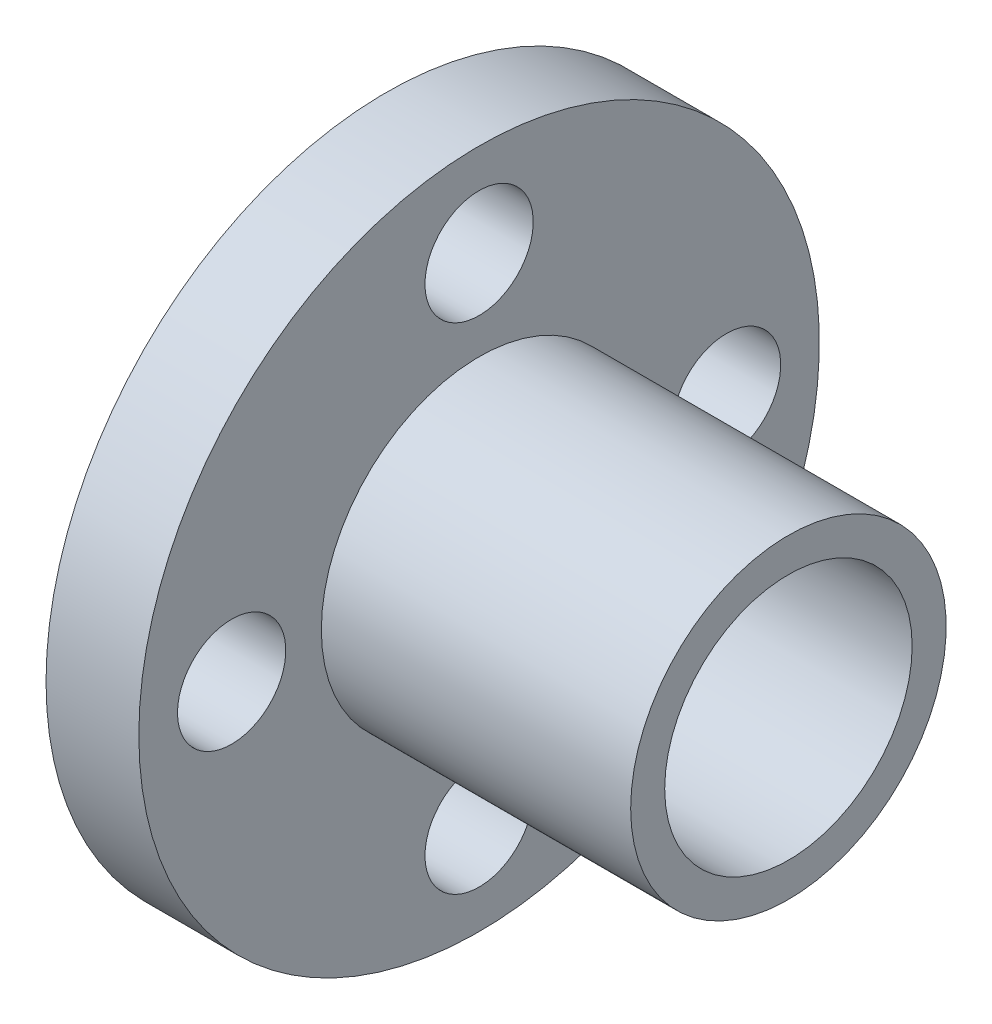
ISO-10303-21;
HEADER;
FILE_DESCRIPTION(('STEP AP214'),'2;1');
FILE_NAME('part.step','',(''),(''),'','','');
FILE_SCHEMA(('AUTOMOTIVE_DESIGN { 1 0 10303 214 1 1 1 1 }'));
ENDSEC;
DATA;
#1=APPLICATION_CONTEXT('core data for automotive mechanical design processes');
#2=APPLICATION_PROTOCOL_DEFINITION('international standard','automotive_design',2000,#1);
#3=PRODUCT_CONTEXT('',#1,'mechanical');
#4=PRODUCT('Part','Part','',(#3));
#5=PRODUCT_RELATED_PRODUCT_CATEGORY('part','',(#4));
#6=PRODUCT_DEFINITION_FORMATION('','',#4);
#7=PRODUCT_DEFINITION_CONTEXT('part definition',#1,'design');
#8=PRODUCT_DEFINITION('design','',#6,#7);
#9=PRODUCT_DEFINITION_SHAPE('','',#8);
#10=(LENGTH_UNIT() NAMED_UNIT(*) SI_UNIT(.MILLI.,.METRE.));
#11=(NAMED_UNIT(*) PLANE_ANGLE_UNIT() SI_UNIT($,.RADIAN.));
#12=(NAMED_UNIT(*) SI_UNIT($,.STERADIAN.) SOLID_ANGLE_UNIT());
#13=UNCERTAINTY_MEASURE_WITH_UNIT(LENGTH_MEASURE(1.E-05),#10,'distance_accuracy_value','');
#14=(GEOMETRIC_REPRESENTATION_CONTEXT(3) GLOBAL_UNCERTAINTY_ASSIGNED_CONTEXT((#13)) GLOBAL_UNIT_ASSIGNED_CONTEXT((#10,
#11,#12)) REPRESENTATION_CONTEXT('',''));
#15=CARTESIAN_POINT('',(0.,0.,0.));
#16=DIRECTION('',(0.,0.,1.));
#17=DIRECTION('',(1.,0.,0.));
#18=AXIS2_PLACEMENT_3D('',#15,#16,#17);
#19=CARTESIAN_POINT('',(-7.24999999999998,0.,0.));
#20=DIRECTION('',(-1.,0.,0.));
#21=DIRECTION('',(0.,0.,1.));
#22=AXIS2_PLACEMENT_3D('',#19,#20,#21);
#23=CYLINDRICAL_SURFACE('',#22,5.10000000000055);
#24=CARTESIAN_POINT('',(-5.74999999999992,0.,0.));
#25=DIRECTION('',(-1.,0.,0.));
#26=DIRECTION('',(0.,0.,1.));
#27=AXIS2_PLACEMENT_3D('',#24,#25,#26);
#28=CIRCLE('',#27,5.10000000000055);
#29=CARTESIAN_POINT('',(-5.74999999999992,0.,5.10000000000055));
#30=VERTEX_POINT('',#29);
#31=EDGE_CURVE('E60',#30,#30,#28,.T.);
#32=ORIENTED_EDGE('',*,*,#31,.T.);
#33=EDGE_LOOP('',(#32));
#34=FACE_BOUND('',#33,.T.);
#35=CARTESIAN_POINT('',(-7.24999999999998,0.,0.));
#36=DIRECTION('',(-1.,0.,0.));
#37=DIRECTION('',(0.,0.,1.));
#38=AXIS2_PLACEMENT_3D('',#35,#36,#37);
#39=CIRCLE('',#38,5.10000000000055);
#40=CARTESIAN_POINT('',(-7.24999999999998,0.,5.10000000000055));
#41=VERTEX_POINT('',#40);
#42=EDGE_CURVE('E10',#41,#41,#39,.T.);
#43=ORIENTED_EDGE('',*,*,#42,.F.);
#44=EDGE_LOOP('',(#43));
#45=FACE_BOUND('',#44,.T.);
#46=ADVANCED_FACE('F32',(#34,#45),#23,.T.);
#47=CARTESIAN_POINT('',(-7.24999999999998,-4.,0.));
#48=DIRECTION('',(-1.,0.,0.));
#49=DIRECTION('',(0.,0.,1.));
#50=AXIS2_PLACEMENT_3D('',#47,#48,#49);
#51=PLANE('',#50);
#52=ORIENTED_EDGE('',*,*,#42,.T.);
#53=EDGE_LOOP('',(#52));
#54=FACE_BOUND('',#53,.T.);
#55=CARTESIAN_POINT('',(-7.24999999999998,0.,0.));
#56=DIRECTION('',(-1.,0.,0.));
#57=DIRECTION('',(0.,0.,1.));
#58=AXIS2_PLACEMENT_3D('',#55,#56,#57);
#59=CIRCLE('',#58,4.);
#60=CARTESIAN_POINT('',(-7.24999999999998,0.,4.));
#61=VERTEX_POINT('',#60);
#62=EDGE_CURVE('E38',#61,#61,#59,.T.);
#63=ORIENTED_EDGE('',*,*,#62,.F.);
#64=EDGE_LOOP('',(#63));
#65=FACE_BOUND('',#64,.T.);
#66=ADVANCED_FACE('F113',(#54,#65),#51,.T.);
#67=CARTESIAN_POINT('',(-7.24999999999998,0.,0.));
#68=DIRECTION('',(-1.,0.,0.));
#69=DIRECTION('',(0.,0.,1.));
#70=AXIS2_PLACEMENT_3D('',#67,#68,#69);
#71=CYLINDRICAL_SURFACE('',#70,4.);
#72=ORIENTED_EDGE('',*,*,#62,.T.);
#73=EDGE_LOOP('',(#72));
#74=FACE_BOUND('',#73,.T.);
#75=CARTESIAN_POINT('',(7.24999999999998,0.,0.));
#76=DIRECTION('',(-1.,0.,0.));
#77=DIRECTION('',(0.,0.,1.));
#78=AXIS2_PLACEMENT_3D('',#75,#76,#77);
#79=CIRCLE('',#78,4.);
#80=CARTESIAN_POINT('',(7.24999999999998,0.,4.));
#81=VERTEX_POINT('',#80);
#82=EDGE_CURVE('E42',#81,#81,#79,.T.);
#83=ORIENTED_EDGE('',*,*,#82,.F.);
#84=EDGE_LOOP('',(#83));
#85=FACE_BOUND('',#84,.T.);
#86=ADVANCED_FACE('F117',(#74,#85),#71,.F.);
#87=CARTESIAN_POINT('',(7.24999999999998,-4.,0.));
#88=DIRECTION('',(1.,0.,0.));
#89=DIRECTION('',(0.,0.,-1.));
#90=AXIS2_PLACEMENT_3D('',#87,#88,#89);
#91=PLANE('',#90);
#92=ORIENTED_EDGE('',*,*,#82,.T.);
#93=EDGE_LOOP('',(#92));
#94=FACE_BOUND('',#93,.T.);
#95=CARTESIAN_POINT('',(7.24999999999998,0.,0.));
#96=DIRECTION('',(-1.,0.,0.));
#97=DIRECTION('',(0.,0.,1.));
#98=AXIS2_PLACEMENT_3D('',#95,#96,#97);
#99=CIRCLE('',#98,5.10000000000055);
#100=CARTESIAN_POINT('',(7.24999999999998,0.,5.10000000000055));
#101=VERTEX_POINT('',#100);
#102=EDGE_CURVE('E46',#101,#101,#99,.T.);
#103=ORIENTED_EDGE('',*,*,#102,.F.);
#104=EDGE_LOOP('',(#103));
#105=FACE_BOUND('',#104,.T.);
#106=ADVANCED_FACE('F121',(#94,#105),#91,.T.);
#107=CARTESIAN_POINT('',(-7.24999999999998,0.,0.));
#108=DIRECTION('',(-1.,0.,0.));
#109=DIRECTION('',(0.,0.,1.));
#110=AXIS2_PLACEMENT_3D('',#107,#108,#109);
#111=CYLINDRICAL_SURFACE('',#110,5.10000000000055);
#112=ORIENTED_EDGE('',*,*,#102,.T.);
#113=EDGE_LOOP('',(#112));
#114=FACE_BOUND('',#113,.T.);
#115=CARTESIAN_POINT('',(-2.74999999999981,0.,0.));
#116=DIRECTION('',(-1.,0.,0.));
#117=DIRECTION('',(0.,0.,1.));
#118=AXIS2_PLACEMENT_3D('',#115,#116,#117);
#119=CIRCLE('',#118,5.10000000000055);
#120=CARTESIAN_POINT('',(-2.74999999999981,0.,5.10000000000055));
#121=VERTEX_POINT('',#120);
#122=EDGE_CURVE('E51',#121,#121,#119,.T.);
#123=ORIENTED_EDGE('',*,*,#122,.F.);
#124=EDGE_LOOP('',(#123));
#125=FACE_BOUND('',#124,.T.);
#126=ADVANCED_FACE('F127',(#114,#125),#111,.T.);
#127=CARTESIAN_POINT('',(-2.74999999999981,-5.10000000000055,0.));
#128=DIRECTION('',(1.,0.,0.));
#129=DIRECTION('',(0.,0.,-1.));
#130=AXIS2_PLACEMENT_3D('',#127,#128,#129);
#131=PLANE('',#130);
#132=CARTESIAN_POINT('',(-2.74999999999992,-8.00000000000001,0.));
#133=DIRECTION('',(-1.,0.,0.));
#134=DIRECTION('',(0.,0.,1.));
#135=AXIS2_PLACEMENT_3D('',#132,#133,#134);
#136=CIRCLE('',#135,1.74999999999992);
#137=CARTESIAN_POINT('',(-2.74999999999992,-8.00000000000001,1.74999999999992));
#138=VERTEX_POINT('',#137);
#139=EDGE_CURVE('E67',#138,#138,#136,.T.);
#140=ORIENTED_EDGE('',*,*,#139,.T.);
#141=EDGE_LOOP('',(#140));
#142=FACE_BOUND('',#141,.T.);
#143=CARTESIAN_POINT('',(-2.74999999999992,0.,8.00000000000001));
#144=DIRECTION('',(-1.,0.,0.));
#145=DIRECTION('',(0.,0.,1.));
#146=AXIS2_PLACEMENT_3D('',#143,#144,#145);
#147=CIRCLE('',#146,1.74999999999992);
#148=CARTESIAN_POINT('',(-2.74999999999992,0.,9.74999999999993));
#149=VERTEX_POINT('',#148);
#150=EDGE_CURVE('E73',#149,#149,#147,.T.);
#151=ORIENTED_EDGE('',*,*,#150,.T.);
#152=EDGE_LOOP('',(#151));
#153=FACE_BOUND('',#152,.T.);
#154=CARTESIAN_POINT('',(-2.74999999999992,0.,-8.00000000000001));
#155=DIRECTION('',(-1.,0.,0.));
#156=DIRECTION('',(0.,0.,1.));
#157=AXIS2_PLACEMENT_3D('',#154,#155,#156);
#158=CIRCLE('',#157,1.74999999999992);
#159=CARTESIAN_POINT('',(-2.74999999999992,0.,-6.25000000000009));
#160=VERTEX_POINT('',#159);
#161=EDGE_CURVE('E74',#160,#160,#158,.T.);
#162=ORIENTED_EDGE('',*,*,#161,.T.);
#163=EDGE_LOOP('',(#162));
#164=FACE_BOUND('',#163,.T.);
#165=CARTESIAN_POINT('',(-2.74999999999992,8.00000000000001,0.));
#166=DIRECTION('',(-1.,0.,0.));
#167=DIRECTION('',(0.,0.,1.));
#168=AXIS2_PLACEMENT_3D('',#165,#166,#167);
#169=CIRCLE('',#168,1.74999999999992);
#170=CARTESIAN_POINT('',(-2.74999999999992,8.00000000000001,1.74999999999992));
#171=VERTEX_POINT('',#170);
#172=EDGE_CURVE('E63',#171,#171,#169,.T.);
#173=ORIENTED_EDGE('',*,*,#172,.T.);
#174=EDGE_LOOP('',(#173));
#175=FACE_BOUND('',#174,.T.);
#176=ORIENTED_EDGE('',*,*,#122,.T.);
#177=EDGE_LOOP('',(#176));
#178=FACE_BOUND('',#177,.T.);
#179=CARTESIAN_POINT('',(-2.74999999999981,0.,0.));
#180=DIRECTION('',(-1.,0.,0.));
#181=DIRECTION('',(0.,0.,1.));
#182=AXIS2_PLACEMENT_3D('',#179,#180,#181);
#183=CIRCLE('',#182,11.0000000000001);
#184=CARTESIAN_POINT('',(-2.74999999999981,0.,11.0000000000001));
#185=VERTEX_POINT('',#184);
#186=EDGE_CURVE('E54',#185,#185,#183,.T.);
#187=ORIENTED_EDGE('',*,*,#186,.F.);
#188=EDGE_LOOP('',(#187));
#189=FACE_BOUND('',#188,.T.);
#190=ADVANCED_FACE('F88',(#142,#153,#164,#175,#178,#189),#131,.T.);
#191=CARTESIAN_POINT('',(-7.24999999999998,0.,0.));
#192=DIRECTION('',(-1.,0.,0.));
#193=DIRECTION('',(0.,0.,1.));
#194=AXIS2_PLACEMENT_3D('',#191,#192,#193);
#195=CYLINDRICAL_SURFACE('',#194,11.0000000000001);
#196=ORIENTED_EDGE('',*,*,#186,.T.);
#197=EDGE_LOOP('',(#196));
#198=FACE_BOUND('',#197,.T.);
#199=CARTESIAN_POINT('',(-5.74999999999992,0.,0.));
#200=DIRECTION('',(-1.,0.,0.));
#201=DIRECTION('',(0.,0.,1.));
#202=AXIS2_PLACEMENT_3D('',#199,#200,#201);
#203=CIRCLE('',#202,11.0000000000001);
#204=CARTESIAN_POINT('',(-5.74999999999992,0.,11.0000000000001));
#205=VERTEX_POINT('',#204);
#206=EDGE_CURVE('E57',#205,#205,#203,.T.);
#207=ORIENTED_EDGE('',*,*,#206,.F.);
#208=EDGE_LOOP('',(#207));
#209=FACE_BOUND('',#208,.T.);
#210=ADVANCED_FACE('F102',(#198,#209),#195,.T.);
#211=CARTESIAN_POINT('',(-5.74999999999992,-5.10000000000055,0.));
#212=DIRECTION('',(-1.,0.,0.));
#213=DIRECTION('',(0.,0.,1.));
#214=AXIS2_PLACEMENT_3D('',#211,#212,#213);
#215=PLANE('',#214);
#216=CARTESIAN_POINT('',(-5.74999999999992,-8.00000000000001,0.));
#217=DIRECTION('',(-1.,0.,0.));
#218=DIRECTION('',(0.,0.,1.));
#219=AXIS2_PLACEMENT_3D('',#216,#217,#218);
#220=CIRCLE('',#219,1.74999999999992);
#221=CARTESIAN_POINT('',(-5.74999999999992,-8.00000000000001,1.74999999999992));
#222=VERTEX_POINT('',#221);
#223=EDGE_CURVE('E77',#222,#222,#220,.T.);
#224=ORIENTED_EDGE('',*,*,#223,.F.);
#225=EDGE_LOOP('',(#224));
#226=FACE_BOUND('',#225,.T.);
#227=CARTESIAN_POINT('',(-5.74999999999992,0.,8.00000000000001));
#228=DIRECTION('',(-1.,0.,0.));
#229=DIRECTION('',(0.,0.,1.));
#230=AXIS2_PLACEMENT_3D('',#227,#228,#229);
#231=CIRCLE('',#230,1.74999999999992);
#232=CARTESIAN_POINT('',(-5.74999999999992,0.,9.74999999999993));
#233=VERTEX_POINT('',#232);
#234=EDGE_CURVE('E70',#233,#233,#231,.T.);
#235=ORIENTED_EDGE('',*,*,#234,.F.);
#236=EDGE_LOOP('',(#235));
#237=FACE_BOUND('',#236,.T.);
#238=CARTESIAN_POINT('',(-5.74999999999992,0.,-8.00000000000001));
#239=DIRECTION('',(-1.,0.,0.));
#240=DIRECTION('',(0.,0.,1.));
#241=AXIS2_PLACEMENT_3D('',#238,#239,#240);
#242=CIRCLE('',#241,1.74999999999992);
#243=CARTESIAN_POINT('',(-5.74999999999992,0.,-6.25000000000009));
#244=VERTEX_POINT('',#243);
#245=EDGE_CURVE('E82',#244,#244,#242,.T.);
#246=ORIENTED_EDGE('',*,*,#245,.F.);
#247=EDGE_LOOP('',(#246));
#248=FACE_BOUND('',#247,.T.);
#249=CARTESIAN_POINT('',(-5.74999999999992,8.00000000000001,0.));
#250=DIRECTION('',(-1.,0.,0.));
#251=DIRECTION('',(0.,0.,1.));
#252=AXIS2_PLACEMENT_3D('',#249,#250,#251);
#253=CIRCLE('',#252,1.74999999999992);
#254=CARTESIAN_POINT('',(-5.74999999999992,8.00000000000001,1.74999999999992));
#255=VERTEX_POINT('',#254);
#256=EDGE_CURVE('E64',#255,#255,#253,.T.);
#257=ORIENTED_EDGE('',*,*,#256,.F.);
#258=EDGE_LOOP('',(#257));
#259=FACE_BOUND('',#258,.T.);
#260=ORIENTED_EDGE('',*,*,#206,.T.);
#261=EDGE_LOOP('',(#260));
#262=FACE_BOUND('',#261,.T.);
#263=ORIENTED_EDGE('',*,*,#31,.F.);
#264=EDGE_LOOP('',(#263));
#265=FACE_BOUND('',#264,.T.);
#266=ADVANCED_FACE('F99',(#226,#237,#248,#259,#262,#265),#215,.T.);
#267=CARTESIAN_POINT('',(-2.74999999999992,8.00000000000001,0.));
#268=DIRECTION('',(-1.,0.,0.));
#269=DIRECTION('',(0.,0.,1.));
#270=AXIS2_PLACEMENT_3D('',#267,#268,#269);
#271=CYLINDRICAL_SURFACE('',#270,1.74999999999992);
#272=ORIENTED_EDGE('',*,*,#172,.F.);
#273=EDGE_LOOP('',(#272));
#274=FACE_BOUND('',#273,.T.);
#275=ORIENTED_EDGE('',*,*,#256,.T.);
#276=EDGE_LOOP('',(#275));
#277=FACE_BOUND('',#276,.T.);
#278=ADVANCED_FACE('F95',(#274,#277),#271,.F.);
#279=CARTESIAN_POINT('',(-2.74999999999992,0.,-8.00000000000001));
#280=DIRECTION('',(-1.,0.,0.));
#281=DIRECTION('',(0.,0.,1.));
#282=AXIS2_PLACEMENT_3D('',#279,#280,#281);
#283=CYLINDRICAL_SURFACE('',#282,1.74999999999992);
#284=ORIENTED_EDGE('',*,*,#161,.F.);
#285=EDGE_LOOP('',(#284));
#286=FACE_BOUND('',#285,.T.);
#287=ORIENTED_EDGE('',*,*,#245,.T.);
#288=EDGE_LOOP('',(#287));
#289=FACE_BOUND('',#288,.T.);
#290=ADVANCED_FACE('F91',(#286,#289),#283,.F.);
#291=CARTESIAN_POINT('',(-2.74999999999992,0.,8.00000000000001));
#292=DIRECTION('',(-1.,0.,0.));
#293=DIRECTION('',(0.,0.,1.));
#294=AXIS2_PLACEMENT_3D('',#291,#292,#293);
#295=CYLINDRICAL_SURFACE('',#294,1.74999999999992);
#296=ORIENTED_EDGE('',*,*,#150,.F.);
#297=EDGE_LOOP('',(#296));
#298=FACE_BOUND('',#297,.T.);
#299=ORIENTED_EDGE('',*,*,#234,.T.);
#300=EDGE_LOOP('',(#299));
#301=FACE_BOUND('',#300,.T.);
#302=ADVANCED_FACE('F94',(#298,#301),#295,.F.);
#303=CARTESIAN_POINT('',(-2.74999999999992,-8.00000000000001,0.));
#304=DIRECTION('',(-1.,0.,0.));
#305=DIRECTION('',(0.,0.,1.));
#306=AXIS2_PLACEMENT_3D('',#303,#304,#305);
#307=CYLINDRICAL_SURFACE('',#306,1.74999999999992);
#308=ORIENTED_EDGE('',*,*,#139,.F.);
#309=EDGE_LOOP('',(#308));
#310=FACE_BOUND('',#309,.T.);
#311=ORIENTED_EDGE('',*,*,#223,.T.);
#312=EDGE_LOOP('',(#311));
#313=FACE_BOUND('',#312,.T.);
#314=ADVANCED_FACE('F143',(#310,#313),#307,.F.);
#315=CLOSED_SHELL('',(#46,#66,#86,#106,#126,#190,#210,#266,#278,#290,#302,#314));
#316=MANIFOLD_SOLID_BREP('B2',#315);
#317=ADVANCED_BREP_SHAPE_REPRESENTATION('',(#18,#316),#14);
#318=SHAPE_DEFINITION_REPRESENTATION(#9,#317);
ENDSEC;
END-ISO-10303-21;
